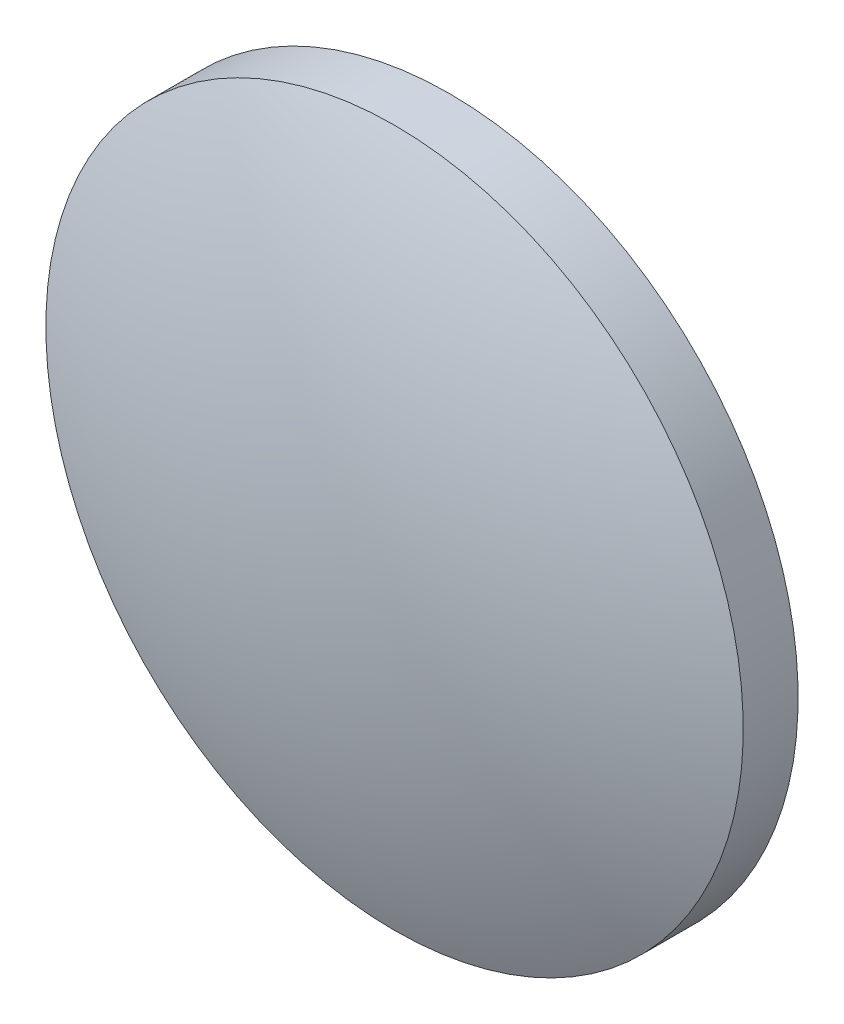
ISO-10303-21;
HEADER;
FILE_DESCRIPTION(('STEP AP214'),'2;1');
FILE_NAME('part.step','',(''),(''),'','','');
FILE_SCHEMA(('AUTOMOTIVE_DESIGN { 1 0 10303 214 1 1 1 1 }'));
ENDSEC;
DATA;
#1=APPLICATION_CONTEXT('core data for automotive mechanical design processes');
#2=APPLICATION_PROTOCOL_DEFINITION('international standard','automotive_design',2000,#1);
#3=PRODUCT_CONTEXT('',#1,'mechanical');
#4=PRODUCT('Part','Part','',(#3));
#5=PRODUCT_RELATED_PRODUCT_CATEGORY('part','',(#4));
#6=PRODUCT_DEFINITION_FORMATION('','',#4);
#7=PRODUCT_DEFINITION_CONTEXT('part definition',#1,'design');
#8=PRODUCT_DEFINITION('design','',#6,#7);
#9=PRODUCT_DEFINITION_SHAPE('','',#8);
#10=(LENGTH_UNIT() NAMED_UNIT(*) SI_UNIT(.MILLI.,.METRE.));
#11=(NAMED_UNIT(*) PLANE_ANGLE_UNIT() SI_UNIT($,.RADIAN.));
#12=(NAMED_UNIT(*) SI_UNIT($,.STERADIAN.) SOLID_ANGLE_UNIT());
#13=UNCERTAINTY_MEASURE_WITH_UNIT(LENGTH_MEASURE(1.E-05),#10,'distance_accuracy_value','');
#14=(GEOMETRIC_REPRESENTATION_CONTEXT(3) GLOBAL_UNCERTAINTY_ASSIGNED_CONTEXT((#13)) GLOBAL_UNIT_ASSIGNED_CONTEXT((#10,
#11,#12)) REPRESENTATION_CONTEXT('',''));
#15=CARTESIAN_POINT('',(0.,0.,0.));
#16=DIRECTION('',(0.,0.,1.));
#17=DIRECTION('',(1.,0.,0.));
#18=AXIS2_PLACEMENT_3D('',#15,#16,#17);
#19=CARTESIAN_POINT('',(0.,0.,-2.29));
#20=DIRECTION('',(0.,0.,-1.));
#21=DIRECTION('',(0.,1.,0.));
#22=AXIS2_PLACEMENT_3D('',#19,#20,#21);
#23=PLANE('',#22);
#24=CARTESIAN_POINT('',(0.,0.,-2.29));
#25=DIRECTION('',(0.,0.,-1.));
#26=DIRECTION('',(0.,1.,0.));
#27=AXIS2_PLACEMENT_3D('',#24,#25,#26);
#28=CIRCLE('',#27,12.7);
#29=CARTESIAN_POINT('',(0.,12.7,-2.29));
#30=VERTEX_POINT('',#29);
#31=EDGE_CURVE('E19',#30,#30,#28,.T.);
#32=ORIENTED_EDGE('',*,*,#31,.T.);
#33=EDGE_LOOP('',(#32));
#34=FACE_BOUND('',#33,.T.);
#35=ADVANCED_FACE('F13',(#34),#23,.T.);
#36=CARTESIAN_POINT('',(0.,0.,-30.2500000000001));
#37=DIRECTION('',(0.,0.,-1.));
#38=DIRECTION('',(0.,1.,0.));
#39=AXIS2_PLACEMENT_3D('',#36,#37,#38);
#40=SPHERICAL_SURFACE('',#39,32.5400000000001);
#41=CARTESIAN_POINT('',(0.,0.,-0.29066756417958));
#42=DIRECTION('',(0.,0.,-1.));
#43=DIRECTION('',(0.,1.,0.));
#44=AXIS2_PLACEMENT_3D('',#41,#42,#43);
#45=CIRCLE('',#44,12.7);
#46=CARTESIAN_POINT('',(0.,12.7,-0.290667564179576));
#47=VERTEX_POINT('',#46);
#48=EDGE_CURVE('E9',#47,#47,#45,.T.);
#49=ORIENTED_EDGE('',*,*,#48,.F.);
#50=EDGE_LOOP('',(#49));
#51=FACE_BOUND('',#50,.T.);
#52=ADVANCED_FACE('F28',(#51),#40,.T.);
#53=CARTESIAN_POINT('',(0.,0.,-2.29));
#54=DIRECTION('',(0.,0.,-1.));
#55=DIRECTION('',(0.,1.,0.));
#56=AXIS2_PLACEMENT_3D('',#53,#54,#55);
#57=CYLINDRICAL_SURFACE('',#56,12.7);
#58=ORIENTED_EDGE('',*,*,#48,.T.);
#59=EDGE_LOOP('',(#58));
#60=FACE_BOUND('',#59,.T.);
#61=ORIENTED_EDGE('',*,*,#31,.F.);
#62=EDGE_LOOP('',(#61));
#63=FACE_BOUND('',#62,.T.);
#64=ADVANCED_FACE('F26',(#60,#63),#57,.T.);
#65=CLOSED_SHELL('',(#35,#52,#64));
#66=MANIFOLD_SOLID_BREP('B1',#65);
#67=ADVANCED_BREP_SHAPE_REPRESENTATION('',(#18,#66),#14);
#68=SHAPE_DEFINITION_REPRESENTATION(#9,#67);
ENDSEC;
END-ISO-10303-21;
